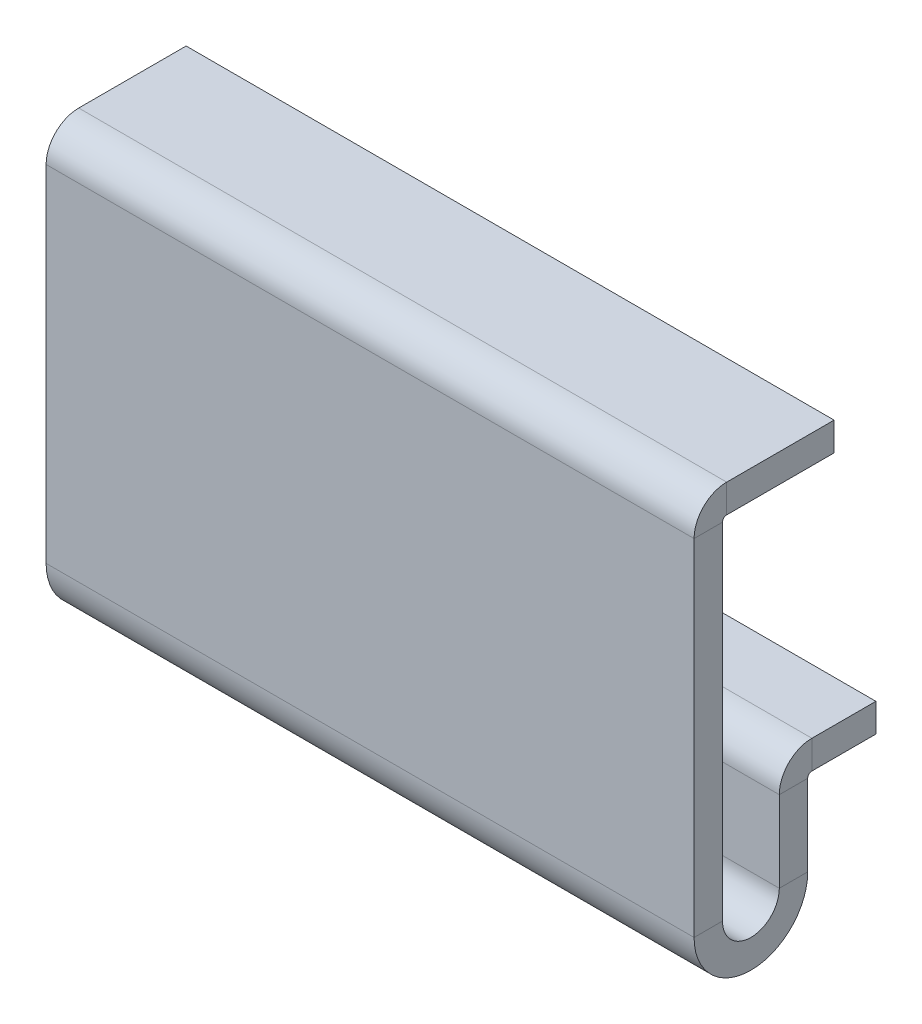
ISO-10303-21;
HEADER;
FILE_DESCRIPTION(('STEP AP214'),'2;1');
FILE_NAME('part.step','',(''),(''),'','','');
FILE_SCHEMA(('AUTOMOTIVE_DESIGN { 1 0 10303 214 1 1 1 1 }'));
ENDSEC;
DATA;
#1=APPLICATION_CONTEXT('core data for automotive mechanical design processes');
#2=APPLICATION_PROTOCOL_DEFINITION('international standard','automotive_design',2000,#1);
#3=PRODUCT_CONTEXT('',#1,'mechanical');
#4=PRODUCT('Part','Part','',(#3));
#5=PRODUCT_RELATED_PRODUCT_CATEGORY('part','',(#4));
#6=PRODUCT_DEFINITION_FORMATION('','',#4);
#7=PRODUCT_DEFINITION_CONTEXT('part definition',#1,'design');
#8=PRODUCT_DEFINITION('design','',#6,#7);
#9=PRODUCT_DEFINITION_SHAPE('','',#8);
#10=(LENGTH_UNIT() NAMED_UNIT(*) SI_UNIT(.MILLI.,.METRE.));
#11=(NAMED_UNIT(*) PLANE_ANGLE_UNIT() SI_UNIT($,.RADIAN.));
#12=(NAMED_UNIT(*) SI_UNIT($,.STERADIAN.) SOLID_ANGLE_UNIT());
#13=UNCERTAINTY_MEASURE_WITH_UNIT(LENGTH_MEASURE(1.E-05),#10,'distance_accuracy_value','');
#14=(GEOMETRIC_REPRESENTATION_CONTEXT(3) GLOBAL_UNCERTAINTY_ASSIGNED_CONTEXT((#13)) GLOBAL_UNIT_ASSIGNED_CONTEXT((#10,
#11,#12)) REPRESENTATION_CONTEXT('',''));
#15=CARTESIAN_POINT('',(0.,0.,0.));
#16=DIRECTION('',(0.,0.,1.));
#17=DIRECTION('',(1.,0.,0.));
#18=AXIS2_PLACEMENT_3D('',#15,#16,#17);
#19=CARTESIAN_POINT('',(-57.0262748258092,18.2568575522724,-27.7533473212653));
#20=DIRECTION('',(-1.,0.,0.));
#21=DIRECTION('',(0.,-1.,0.));
#22=AXIS2_PLACEMENT_3D('',#19,#20,#21);
#23=PLANE('',#22);
#24=DIRECTION('',(0.,-1.,0.));
#25=VECTOR('',#24,1.);
#26=CARTESIAN_POINT('',(-57.0262748258092,18.2568575522724,-22.7533473212653));
#27=LINE('',#26,#25);
#28=CARTESIAN_POINT('',(-57.0262748258092,-5.73660000000002,-22.7533473212654));
#29=VERTEX_POINT('',#28);
#30=CARTESIAN_POINT('',(-57.0262748258092,-66.5418734121946,-22.7533473212656));
#31=VERTEX_POINT('',#30);
#32=EDGE_CURVE('E101',#29,#31,#27,.T.);
#33=ORIENTED_EDGE('',*,*,#32,.F.);
#34=DIRECTION('',(0.,0.,-1.));
#35=VECTOR('',#34,1.);
#36=CARTESIAN_POINT('',(-57.0262748258092,-5.73660000000001,-27.7533473212654));
#37=LINE('',#36,#35);
#38=CARTESIAN_POINT('',(-57.0262748258091,-5.7366,-27.7533473212654));
#39=VERTEX_POINT('',#38);
#40=EDGE_CURVE('E190',#29,#39,#37,.T.);
#41=ORIENTED_EDGE('',*,*,#40,.T.);
#42=DIRECTION('',(0.,-1.,0.));
#43=VECTOR('',#42,1.);
#44=CARTESIAN_POINT('',(-57.0262748258092,18.2568575522724,-27.7533473212653));
#45=LINE('',#44,#43);
#46=CARTESIAN_POINT('',(-57.0262748258092,-66.5418734121945,-27.7533473212656));
#47=VERTEX_POINT('',#46);
#48=EDGE_CURVE('E81',#39,#47,#45,.T.);
#49=ORIENTED_EDGE('',*,*,#48,.T.);
#50=DIRECTION('',(0.,0.,1.));
#51=VECTOR('',#50,1.);
#52=CARTESIAN_POINT('',(-57.0262748258092,-66.5418734121945,-27.7533473212656));
#53=LINE('',#52,#51);
#54=EDGE_CURVE('E316',#47,#31,#53,.T.);
#55=ORIENTED_EDGE('',*,*,#54,.T.);
#56=EDGE_LOOP('',(#33,#41,#49,#55));
#57=FACE_BOUND('',#56,.T.);
#58=ADVANCED_FACE('F77',(#57),#23,.T.);
#59=CARTESIAN_POINT('',(57.0262748258092,18.2568575522724,-27.7533473212653));
#60=DIRECTION('',(1.,0.,0.));
#61=DIRECTION('',(0.,1.,0.));
#62=AXIS2_PLACEMENT_3D('',#59,#60,#61);
#63=PLANE('',#62);
#64=DIRECTION('',(0.,1.,0.));
#65=VECTOR('',#64,1.);
#66=CARTESIAN_POINT('',(57.0262748258092,18.2568575522724,-27.7533473212653));
#67=LINE('',#66,#65);
#68=CARTESIAN_POINT('',(57.0262748258092,-66.5418734121945,-27.7533473212656));
#69=VERTEX_POINT('',#68);
#70=CARTESIAN_POINT('',(57.0262748258092,-5.7366,-27.7533473212654));
#71=VERTEX_POINT('',#70);
#72=EDGE_CURVE('E206',#69,#71,#67,.T.);
#73=ORIENTED_EDGE('',*,*,#72,.T.);
#74=DIRECTION('',(0.,0.,1.));
#75=VECTOR('',#74,1.);
#76=CARTESIAN_POINT('',(57.0262748258092,-5.73660000000001,-27.7533473212654));
#77=LINE('',#76,#75);
#78=CARTESIAN_POINT('',(57.0262748258092,-5.73660000000002,-22.7533473212654));
#79=VERTEX_POINT('',#78);
#80=EDGE_CURVE('E15',#71,#79,#77,.T.);
#81=ORIENTED_EDGE('',*,*,#80,.T.);
#82=DIRECTION('',(0.,1.,0.));
#83=VECTOR('',#82,1.);
#84=CARTESIAN_POINT('',(57.0262748258092,18.2568575522724,-22.7533473212653));
#85=LINE('',#84,#83);
#86=CARTESIAN_POINT('',(57.0262748258092,-66.5418734121946,-22.7533473212656));
#87=VERTEX_POINT('',#86);
#88=EDGE_CURVE('E94',#87,#79,#85,.T.);
#89=ORIENTED_EDGE('',*,*,#88,.F.);
#90=DIRECTION('',(0.,0.,1.));
#91=VECTOR('',#90,1.);
#92=CARTESIAN_POINT('',(57.0262748258092,-66.5418734121945,-27.7533473212656));
#93=LINE('',#92,#91);
#94=EDGE_CURVE('E324',#69,#87,#93,.T.);
#95=ORIENTED_EDGE('',*,*,#94,.F.);
#96=EDGE_LOOP('',(#73,#81,#89,#95));
#97=FACE_BOUND('',#96,.T.);
#98=ADVANCED_FACE('F79',(#97),#63,.T.);
#99=CARTESIAN_POINT('',(0.,-29.1425079299611,-22.7533473212655));
#100=DIRECTION('',(0.,0.,1.));
#101=DIRECTION('',(0.,-1.,0.));
#102=AXIS2_PLACEMENT_3D('',#99,#100,#101);
#103=PLANE('',#102);
#104=ORIENTED_EDGE('',*,*,#88,.T.);
#105=DIRECTION('',(-1.,0.,0.));
#106=VECTOR('',#105,1.);
#107=CARTESIAN_POINT('',(0.,-5.73660000000003,-22.7533473212654));
#108=LINE('',#107,#106);
#109=EDGE_CURVE('E86',#79,#29,#108,.T.);
#110=ORIENTED_EDGE('',*,*,#109,.T.);
#111=ORIENTED_EDGE('',*,*,#32,.T.);
#112=DIRECTION('',(-1.,0.,0.));
#113=VECTOR('',#112,1.);
#114=CARTESIAN_POINT('',(-57.0262748258092,-66.5418734121946,-22.7533473212656));
#115=LINE('',#114,#113);
#116=EDGE_CURVE('E310',#31,#87,#115,.F.);
#117=ORIENTED_EDGE('',*,*,#116,.T.);
#118=EDGE_LOOP('',(#104,#110,#111,#117));
#119=FACE_BOUND('',#118,.T.);
#120=ADVANCED_FACE('F351',(#119),#103,.T.);
#121=CARTESIAN_POINT('',(57.0262748258092,-56.5418734121945,-42.7533473212656));
#122=DIRECTION('',(-1.,0.,0.));
#123=DIRECTION('',(0.,1.,0.));
#124=AXIS2_PLACEMENT_3D('',#121,#122,#123);
#125=PLANE('',#124);
#126=DIRECTION('',(0.,1.,0.));
#127=VECTOR('',#126,1.);
#128=CARTESIAN_POINT('',(57.0262748258092,-56.5418734121945,-42.7533473212656));
#129=LINE('',#128,#127);
#130=CARTESIAN_POINT('',(57.0262748258092,-66.5418734121945,-42.7533473212656));
#131=VERTEX_POINT('',#130);
#132=CARTESIAN_POINT('',(57.0262748258092,-52.2784734121945,-42.7533473212656));
#133=VERTEX_POINT('',#132);
#134=EDGE_CURVE('E334',#131,#133,#129,.T.);
#135=ORIENTED_EDGE('',*,*,#134,.T.);
#136=DIRECTION('',(0.,0.,1.));
#137=VECTOR('',#136,1.);
#138=CARTESIAN_POINT('',(57.0262748258092,-52.2784734121945,-42.7533473212656));
#139=LINE('',#138,#137);
#140=CARTESIAN_POINT('',(57.0262748258092,-52.2784734121945,-37.7533473212656));
#141=VERTEX_POINT('',#140);
#142=EDGE_CURVE('E294',#133,#141,#139,.T.);
#143=ORIENTED_EDGE('',*,*,#142,.T.);
#144=DIRECTION('',(0.,1.,0.));
#145=VECTOR('',#144,1.);
#146=CARTESIAN_POINT('',(57.0262748258092,-56.5418734121945,-37.7533473212656));
#147=LINE('',#146,#145);
#148=CARTESIAN_POINT('',(57.0262748258092,-66.5418734121945,-37.7533473212656));
#149=VERTEX_POINT('',#148);
#150=EDGE_CURVE('E326',#149,#141,#147,.T.);
#151=ORIENTED_EDGE('',*,*,#150,.F.);
#152=DIRECTION('',(0.,0.,-1.));
#153=VECTOR('',#152,1.);
#154=CARTESIAN_POINT('',(57.0262748258092,-66.5418734121945,-42.7533473212657));
#155=LINE('',#154,#153);
#156=EDGE_CURVE('E345',#149,#131,#155,.T.);
#157=ORIENTED_EDGE('',*,*,#156,.T.);
#158=EDGE_LOOP('',(#135,#143,#151,#157));
#159=FACE_BOUND('',#158,.T.);
#160=ADVANCED_FACE('F377',(#159),#125,.F.);
#161=CARTESIAN_POINT('',(0.,-56.5418734121945,-42.7533473212656));
#162=DIRECTION('',(0.,0.,-1.));
#163=DIRECTION('',(0.,1.,0.));
#164=AXIS2_PLACEMENT_3D('',#161,#162,#163);
#165=PLANE('',#164);
#166=DIRECTION('',(0.,-1.,0.));
#167=VECTOR('',#166,1.);
#168=CARTESIAN_POINT('',(-57.0262748258092,-56.5418734121945,-42.7533473212656));
#169=LINE('',#168,#167);
#170=CARTESIAN_POINT('',(-57.0262748258092,-52.2784734121945,-42.7533473212656));
#171=VERTEX_POINT('',#170);
#172=CARTESIAN_POINT('',(-57.0262748258092,-66.5418734121945,-42.7533473212657));
#173=VERTEX_POINT('',#172);
#174=EDGE_CURVE('E328',#171,#173,#169,.T.);
#175=ORIENTED_EDGE('',*,*,#174,.F.);
#176=DIRECTION('',(1.,0.,0.));
#177=VECTOR('',#176,1.);
#178=CARTESIAN_POINT('',(57.0262748258092,-52.2784734121945,-42.7533473212656));
#179=LINE('',#178,#177);
#180=EDGE_CURVE('E300',#133,#171,#179,.F.);
#181=ORIENTED_EDGE('',*,*,#180,.F.);
#182=ORIENTED_EDGE('',*,*,#134,.F.);
#183=DIRECTION('',(1.,0.,0.));
#184=VECTOR('',#183,1.);
#185=CARTESIAN_POINT('',(0.,-66.5418734121945,-42.7533473212657));
#186=LINE('',#185,#184);
#187=EDGE_CURVE('E331',#173,#131,#186,.T.);
#188=ORIENTED_EDGE('',*,*,#187,.F.);
#189=EDGE_LOOP('',(#175,#181,#182,#188));
#190=FACE_BOUND('',#189,.T.);
#191=ADVANCED_FACE('F429',(#190),#165,.T.);
#192=CARTESIAN_POINT('',(0.,-56.5418734121945,-37.7533473212656));
#193=DIRECTION('',(0.,0.,-1.));
#194=DIRECTION('',(0.,1.,0.));
#195=AXIS2_PLACEMENT_3D('',#192,#193,#194);
#196=PLANE('',#195);
#197=DIRECTION('',(1.,0.,0.));
#198=VECTOR('',#197,1.);
#199=CARTESIAN_POINT('',(57.0262748258092,-52.2784734121945,-37.7533473212656));
#200=LINE('',#199,#198);
#201=CARTESIAN_POINT('',(-57.0262748258092,-52.2784734121945,-37.7533473212656));
#202=VERTEX_POINT('',#201);
#203=EDGE_CURVE('E288',#141,#202,#200,.F.);
#204=ORIENTED_EDGE('',*,*,#203,.T.);
#205=DIRECTION('',(0.,1.,0.));
#206=VECTOR('',#205,1.);
#207=CARTESIAN_POINT('',(-57.0262748258092,-56.5418734121945,-37.7533473212656));
#208=LINE('',#207,#206);
#209=CARTESIAN_POINT('',(-57.0262748258092,-66.5418734121945,-37.7533473212656));
#210=VERTEX_POINT('',#209);
#211=EDGE_CURVE('E337',#202,#210,#208,.F.);
#212=ORIENTED_EDGE('',*,*,#211,.T.);
#213=DIRECTION('',(1.,0.,0.));
#214=VECTOR('',#213,1.);
#215=CARTESIAN_POINT('',(0.,-66.5418734121945,-37.7533473212656));
#216=LINE('',#215,#214);
#217=EDGE_CURVE('E339',#210,#149,#216,.T.);
#218=ORIENTED_EDGE('',*,*,#217,.T.);
#219=ORIENTED_EDGE('',*,*,#150,.T.);
#220=EDGE_LOOP('',(#204,#212,#218,#219));
#221=FACE_BOUND('',#220,.T.);
#222=ADVANCED_FACE('F373',(#221),#196,.F.);
#223=CARTESIAN_POINT('',(0.,-29.1425079299611,-27.7533473212655));
#224=DIRECTION('',(0.,0.,1.));
#225=DIRECTION('',(0.,-1.,0.));
#226=AXIS2_PLACEMENT_3D('',#223,#224,#225);
#227=PLANE('',#226);
#228=DIRECTION('',(-1.,0.,0.));
#229=VECTOR('',#228,1.);
#230=CARTESIAN_POINT('',(0.,-5.73660000000001,-27.7533473212654));
#231=LINE('',#230,#229);
#232=EDGE_CURVE('E197',#71,#39,#231,.T.);
#233=ORIENTED_EDGE('',*,*,#232,.F.);
#234=ORIENTED_EDGE('',*,*,#72,.F.);
#235=DIRECTION('',(-1.,0.,0.));
#236=VECTOR('',#235,1.);
#237=CARTESIAN_POINT('',(-57.0262748258092,-66.5418734121945,-27.7533473212656));
#238=LINE('',#237,#236);
#239=EDGE_CURVE('E205',#47,#69,#238,.F.);
#240=ORIENTED_EDGE('',*,*,#239,.F.);
#241=ORIENTED_EDGE('',*,*,#48,.F.);
#242=EDGE_LOOP('',(#233,#234,#240,#241));
#243=FACE_BOUND('',#242,.T.);
#244=ADVANCED_FACE('F202',(#243),#227,.F.);
#245=CARTESIAN_POINT('',(-57.0262748258092,-56.5418734121945,-42.7533473212656));
#246=DIRECTION('',(1.,0.,0.));
#247=DIRECTION('',(0.,-1.,0.));
#248=AXIS2_PLACEMENT_3D('',#245,#246,#247);
#249=PLANE('',#248);
#250=DIRECTION('',(0.,0.,1.));
#251=VECTOR('',#250,1.);
#252=CARTESIAN_POINT('',(-57.0262748258092,-52.2784734121945,-42.7533473212656));
#253=LINE('',#252,#251);
#254=EDGE_CURVE('E305',#171,#202,#253,.T.);
#255=ORIENTED_EDGE('',*,*,#254,.F.);
#256=ORIENTED_EDGE('',*,*,#174,.T.);
#257=DIRECTION('',(0.,0.,-1.));
#258=VECTOR('',#257,1.);
#259=CARTESIAN_POINT('',(-57.0262748258092,-66.5418734121945,-42.7533473212657));
#260=LINE('',#259,#258);
#261=EDGE_CURVE('E330',#210,#173,#260,.T.);
#262=ORIENTED_EDGE('',*,*,#261,.F.);
#263=ORIENTED_EDGE('',*,*,#211,.F.);
#264=EDGE_LOOP('',(#255,#256,#262,#263));
#265=FACE_BOUND('',#264,.T.);
#266=ADVANCED_FACE('F365',(#265),#249,.F.);
#267=CARTESIAN_POINT('',(57.0262748258092,-66.5418734121945,-32.7533473212656));
#268=DIRECTION('',(1.,0.,0.));
#269=DIRECTION('',(0.,1.,0.));
#270=AXIS2_PLACEMENT_3D('',#267,#268,#269);
#271=PLANE('',#270);
#272=ORIENTED_EDGE('',*,*,#156,.F.);
#273=CARTESIAN_POINT('',(57.0262748258092,-66.5418734121945,-32.7533473212656));
#274=DIRECTION('',(-1.,0.,0.));
#275=DIRECTION('',(0.,-1.,0.));
#276=AXIS2_PLACEMENT_3D('',#273,#274,#275);
#277=CIRCLE('',#276,5.);
#278=EDGE_CURVE('E319',#69,#149,#277,.F.);
#279=ORIENTED_EDGE('',*,*,#278,.F.);
#280=ORIENTED_EDGE('',*,*,#94,.T.);
#281=CARTESIAN_POINT('',(57.0262748258092,-66.5418734121945,-32.7533473212656));
#282=DIRECTION('',(-1.,0.,0.));
#283=DIRECTION('',(0.,-1.,0.));
#284=AXIS2_PLACEMENT_3D('',#281,#282,#283);
#285=CIRCLE('',#284,10.);
#286=EDGE_CURVE('E312',#87,#131,#285,.F.);
#287=ORIENTED_EDGE('',*,*,#286,.T.);
#288=EDGE_LOOP('',(#272,#279,#280,#287));
#289=FACE_BOUND('',#288,.T.);
#290=ADVANCED_FACE('F380',(#289),#271,.T.);
#291=CARTESIAN_POINT('',(-57.0262748258092,-66.5418734121945,-32.7533473212656));
#292=DIRECTION('',(1.,0.,0.));
#293=DIRECTION('',(0.,1.,0.));
#294=AXIS2_PLACEMENT_3D('',#291,#292,#293);
#295=PLANE('',#294);
#296=CARTESIAN_POINT('',(-57.0262748258092,-66.5418734121945,-32.7533473212656));
#297=DIRECTION('',(-1.,0.,0.));
#298=DIRECTION('',(0.,-1.,0.));
#299=AXIS2_PLACEMENT_3D('',#296,#297,#298);
#300=CIRCLE('',#299,5.);
#301=EDGE_CURVE('E308',#210,#47,#300,.T.);
#302=ORIENTED_EDGE('',*,*,#301,.F.);
#303=ORIENTED_EDGE('',*,*,#261,.T.);
#304=CARTESIAN_POINT('',(-57.0262748258092,-66.5418734121945,-32.7533473212656));
#305=DIRECTION('',(-1.,0.,0.));
#306=DIRECTION('',(0.,-1.,0.));
#307=AXIS2_PLACEMENT_3D('',#304,#305,#306);
#308=CIRCLE('',#307,10.);
#309=EDGE_CURVE('E313',#173,#31,#308,.T.);
#310=ORIENTED_EDGE('',*,*,#309,.T.);
#311=ORIENTED_EDGE('',*,*,#54,.F.);
#312=EDGE_LOOP('',(#302,#303,#310,#311));
#313=FACE_BOUND('',#312,.T.);
#314=ADVANCED_FACE('F360',(#313),#295,.F.);
#315=CARTESIAN_POINT('',(-57.0262748258092,-66.5418734121945,-32.7533473212656));
#316=DIRECTION('',(-1.,0.,0.));
#317=DIRECTION('',(0.,0.,-1.));
#318=AXIS2_PLACEMENT_3D('',#315,#316,#317);
#319=CYLINDRICAL_SURFACE('',#318,10.);
#320=ORIENTED_EDGE('',*,*,#116,.F.);
#321=ORIENTED_EDGE('',*,*,#309,.F.);
#322=ORIENTED_EDGE('',*,*,#187,.T.);
#323=ORIENTED_EDGE('',*,*,#286,.F.);
#324=EDGE_LOOP('',(#320,#321,#322,#323));
#325=FACE_BOUND('',#324,.T.);
#326=ADVANCED_FACE('F356',(#325),#319,.T.);
#327=CARTESIAN_POINT('',(-57.0262748258092,-66.5418734121945,-32.7533473212656));
#328=DIRECTION('',(-1.,0.,0.));
#329=DIRECTION('',(0.,0.,-1.));
#330=AXIS2_PLACEMENT_3D('',#327,#328,#329);
#331=CYLINDRICAL_SURFACE('',#330,5.);
#332=ORIENTED_EDGE('',*,*,#239,.T.);
#333=ORIENTED_EDGE('',*,*,#278,.T.);
#334=ORIENTED_EDGE('',*,*,#217,.F.);
#335=ORIENTED_EDGE('',*,*,#301,.T.);
#336=EDGE_LOOP('',(#332,#333,#334,#335));
#337=FACE_BOUND('',#336,.T.);
#338=ADVANCED_FACE('F369',(#337),#331,.F.);
#339=CARTESIAN_POINT('',(-57.0262748258092,-52.2784734121945,-43.4899473212656));
#340=DIRECTION('',(-1.,0.,0.));
#341=DIRECTION('',(0.,-1.,0.));
#342=AXIS2_PLACEMENT_3D('',#339,#340,#341);
#343=PLANE('',#342);
#344=DIRECTION('',(0.,-1.,0.));
#345=VECTOR('',#344,1.);
#346=CARTESIAN_POINT('',(-57.0262748258092,-46.5418734121945,-43.4899473212655));
#347=LINE('',#346,#345);
#348=CARTESIAN_POINT('',(-57.0262748258092,-51.5418734121945,-43.4899473212656));
#349=VERTEX_POINT('',#348);
#350=CARTESIAN_POINT('',(-57.0262748258092,-46.5418734121945,-43.4899473212656));
#351=VERTEX_POINT('',#350);
#352=EDGE_CURVE('E235',#349,#351,#347,.F.);
#353=ORIENTED_EDGE('',*,*,#352,.F.);
#354=CARTESIAN_POINT('',(-57.0262748258092,-52.2784734121945,-43.4899473212656));
#355=DIRECTION('',(1.,0.,0.));
#356=DIRECTION('',(0.,1.,0.));
#357=AXIS2_PLACEMENT_3D('',#354,#355,#356);
#358=CIRCLE('',#357,0.7366);
#359=EDGE_CURVE('E297',#171,#349,#358,.F.);
#360=ORIENTED_EDGE('',*,*,#359,.F.);
#361=ORIENTED_EDGE('',*,*,#254,.T.);
#362=CARTESIAN_POINT('',(-57.0262748258092,-52.2784734121945,-43.4899473212656));
#363=DIRECTION('',(1.,0.,0.));
#364=DIRECTION('',(0.,1.,0.));
#365=AXIS2_PLACEMENT_3D('',#362,#363,#364);
#366=CIRCLE('',#365,5.7366);
#367=EDGE_CURVE('E290',#202,#351,#366,.F.);
#368=ORIENTED_EDGE('',*,*,#367,.T.);
#369=EDGE_LOOP('',(#353,#360,#361,#368));
#370=FACE_BOUND('',#369,.T.);
#371=ADVANCED_FACE('F446',(#370),#343,.T.);
#372=CARTESIAN_POINT('',(57.0262748258092,-52.2784734121945,-43.4899473212656));
#373=DIRECTION('',(-1.,0.,0.));
#374=DIRECTION('',(0.,-1.,0.));
#375=AXIS2_PLACEMENT_3D('',#372,#373,#374);
#376=PLANE('',#375);
#377=CARTESIAN_POINT('',(57.0262748258092,-52.2784734121945,-43.4899473212656));
#378=DIRECTION('',(1.,0.,0.));
#379=DIRECTION('',(0.,1.,0.));
#380=AXIS2_PLACEMENT_3D('',#377,#378,#379);
#381=CIRCLE('',#380,0.7366);
#382=CARTESIAN_POINT('',(57.0262748258092,-51.5418734121945,-43.4899473212656));
#383=VERTEX_POINT('',#382);
#384=EDGE_CURVE('E261',#383,#133,#381,.T.);
#385=ORIENTED_EDGE('',*,*,#384,.F.);
#386=DIRECTION('',(0.,-1.,0.));
#387=VECTOR('',#386,1.);
#388=CARTESIAN_POINT('',(57.0262748258092,-51.5418734121945,-43.4899473212656));
#389=LINE('',#388,#387);
#390=CARTESIAN_POINT('',(57.0262748258092,-46.5418734121945,-43.4899473212655));
#391=VERTEX_POINT('',#390);
#392=EDGE_CURVE('E281',#383,#391,#389,.F.);
#393=ORIENTED_EDGE('',*,*,#392,.T.);
#394=CARTESIAN_POINT('',(57.0262748258092,-52.2784734121945,-43.4899473212656));
#395=DIRECTION('',(1.,0.,0.));
#396=DIRECTION('',(0.,1.,0.));
#397=AXIS2_PLACEMENT_3D('',#394,#395,#396);
#398=CIRCLE('',#397,5.7366);
#399=EDGE_CURVE('E291',#391,#141,#398,.T.);
#400=ORIENTED_EDGE('',*,*,#399,.T.);
#401=ORIENTED_EDGE('',*,*,#142,.F.);
#402=EDGE_LOOP('',(#385,#393,#400,#401));
#403=FACE_BOUND('',#402,.T.);
#404=ADVANCED_FACE('F449',(#403),#376,.F.);
#405=CARTESIAN_POINT('',(57.0262748258092,-52.2784734121945,-43.4899473212656));
#406=DIRECTION('',(1.,0.,0.));
#407=DIRECTION('',(0.,1.,0.));
#408=AXIS2_PLACEMENT_3D('',#405,#406,#407);
#409=CYLINDRICAL_SURFACE('',#408,5.7366);
#410=ORIENTED_EDGE('',*,*,#203,.F.);
#411=ORIENTED_EDGE('',*,*,#399,.F.);
#412=DIRECTION('',(1.,0.,0.));
#413=VECTOR('',#412,1.);
#414=CARTESIAN_POINT('',(-57.0262748258092,-46.5418734121945,-43.4899473212655));
#415=LINE('',#414,#413);
#416=EDGE_CURVE('E279',#391,#351,#415,.F.);
#417=ORIENTED_EDGE('',*,*,#416,.T.);
#418=ORIENTED_EDGE('',*,*,#367,.F.);
#419=EDGE_LOOP('',(#410,#411,#417,#418));
#420=FACE_BOUND('',#419,.T.);
#421=ADVANCED_FACE('F452',(#420),#409,.T.);
#422=CARTESIAN_POINT('',(57.0262748258092,-52.2784734121945,-43.4899473212656));
#423=DIRECTION('',(1.,0.,0.));
#424=DIRECTION('',(0.,1.,0.));
#425=AXIS2_PLACEMENT_3D('',#422,#423,#424);
#426=CYLINDRICAL_SURFACE('',#425,0.7366);
#427=ORIENTED_EDGE('',*,*,#180,.T.);
#428=ORIENTED_EDGE('',*,*,#359,.T.);
#429=DIRECTION('',(1.,0.,0.));
#430=VECTOR('',#429,1.);
#431=CARTESIAN_POINT('',(-57.0262748258092,-51.5418734121945,-43.4899473212656));
#432=LINE('',#431,#430);
#433=EDGE_CURVE('E284',#349,#383,#432,.T.);
#434=ORIENTED_EDGE('',*,*,#433,.T.);
#435=ORIENTED_EDGE('',*,*,#384,.T.);
#436=EDGE_LOOP('',(#427,#428,#434,#435));
#437=FACE_BOUND('',#436,.T.);
#438=ADVANCED_FACE('F457',(#437),#426,.F.);
#439=CARTESIAN_POINT('',(57.0262748258092,-46.5418734121944,-54.7533473212656));
#440=DIRECTION('',(-1.,0.,0.));
#441=DIRECTION('',(0.,-1.,0.));
#442=AXIS2_PLACEMENT_3D('',#439,#440,#441);
#443=PLANE('',#442);
#444=ORIENTED_EDGE('',*,*,#392,.F.);
#445=DIRECTION('',(0.,0.,1.));
#446=VECTOR('',#445,1.);
#447=CARTESIAN_POINT('',(57.0262748258092,-51.5418734121944,-54.7533473212656));
#448=LINE('',#447,#446);
#449=CARTESIAN_POINT('',(57.0262748258092,-51.5418734121944,-54.7533473212656));
#450=VERTEX_POINT('',#449);
#451=EDGE_CURVE('E277',#383,#450,#448,.F.);
#452=ORIENTED_EDGE('',*,*,#451,.T.);
#453=DIRECTION('',(0.,-1.,0.));
#454=VECTOR('',#453,1.);
#455=CARTESIAN_POINT('',(57.0262748258092,-46.5418734121944,-54.7533473212656));
#456=LINE('',#455,#454);
#457=CARTESIAN_POINT('',(57.0262748258092,-46.5418734121944,-54.7533473212656));
#458=VERTEX_POINT('',#457);
#459=EDGE_CURVE('E258',#458,#450,#456,.T.);
#460=ORIENTED_EDGE('',*,*,#459,.F.);
#461=DIRECTION('',(0.,0.,-1.));
#462=VECTOR('',#461,1.);
#463=CARTESIAN_POINT('',(57.0262748258092,-46.5418734121946,-22.7533473212656));
#464=LINE('',#463,#462);
#465=EDGE_CURVE('E270',#391,#458,#464,.T.);
#466=ORIENTED_EDGE('',*,*,#465,.F.);
#467=EDGE_LOOP('',(#444,#452,#460,#466));
#468=FACE_BOUND('',#467,.T.);
#469=ADVANCED_FACE('F460',(#468),#443,.F.);
#470=CARTESIAN_POINT('',(-57.0262748258092,-46.5418734121945,-42.7533473212656));
#471=DIRECTION('',(1.,0.,0.));
#472=DIRECTION('',(0.,1.,0.));
#473=AXIS2_PLACEMENT_3D('',#470,#471,#472);
#474=PLANE('',#473);
#475=ORIENTED_EDGE('',*,*,#352,.T.);
#476=DIRECTION('',(0.,0.,1.));
#477=VECTOR('',#476,1.);
#478=CARTESIAN_POINT('',(-57.0262748258092,-46.5418734121946,-22.7533473212656));
#479=LINE('',#478,#477);
#480=CARTESIAN_POINT('',(-57.0262748258092,-46.5418734121944,-54.7533473212656));
#481=VERTEX_POINT('',#480);
#482=EDGE_CURVE('E265',#481,#351,#479,.T.);
#483=ORIENTED_EDGE('',*,*,#482,.F.);
#484=DIRECTION('',(0.,-1.,0.));
#485=VECTOR('',#484,1.);
#486=CARTESIAN_POINT('',(-57.0262748258092,-46.5418734121944,-54.7533473212656));
#487=LINE('',#486,#485);
#488=CARTESIAN_POINT('',(-57.0262748258092,-51.5418734121944,-54.7533473212656));
#489=VERTEX_POINT('',#488);
#490=EDGE_CURVE('E262',#481,#489,#487,.T.);
#491=ORIENTED_EDGE('',*,*,#490,.T.);
#492=DIRECTION('',(0.,0.,-1.));
#493=VECTOR('',#492,1.);
#494=CARTESIAN_POINT('',(-57.0262748258092,-51.5418734121945,-42.7533473212656));
#495=LINE('',#494,#493);
#496=EDGE_CURVE('E272',#489,#349,#495,.F.);
#497=ORIENTED_EDGE('',*,*,#496,.T.);
#498=EDGE_LOOP('',(#475,#483,#491,#497));
#499=FACE_BOUND('',#498,.T.);
#500=ADVANCED_FACE('F466',(#499),#474,.F.);
#501=CARTESIAN_POINT('',(0.,-46.5418734121946,-22.7533473212656));
#502=DIRECTION('',(0.,-1.,0.));
#503=DIRECTION('',(0.,0.,-1.));
#504=AXIS2_PLACEMENT_3D('',#501,#502,#503);
#505=PLANE('',#504);
#506=ORIENTED_EDGE('',*,*,#416,.F.);
#507=ORIENTED_EDGE('',*,*,#465,.T.);
#508=DIRECTION('',(-1.,0.,0.));
#509=VECTOR('',#508,1.);
#510=CARTESIAN_POINT('',(0.,-46.5418734121944,-54.7533473212656));
#511=LINE('',#510,#509);
#512=EDGE_CURVE('E268',#458,#481,#511,.T.);
#513=ORIENTED_EDGE('',*,*,#512,.T.);
#514=ORIENTED_EDGE('',*,*,#482,.T.);
#515=EDGE_LOOP('',(#506,#507,#513,#514));
#516=FACE_BOUND('',#515,.T.);
#517=ADVANCED_FACE('F471',(#516),#505,.F.);
#518=CARTESIAN_POINT('',(0.,-51.5418734121946,-22.7533473212657));
#519=DIRECTION('',(0.,-1.,0.));
#520=DIRECTION('',(0.,0.,-1.));
#521=AXIS2_PLACEMENT_3D('',#518,#519,#520);
#522=PLANE('',#521);
#523=ORIENTED_EDGE('',*,*,#451,.F.);
#524=ORIENTED_EDGE('',*,*,#433,.F.);
#525=ORIENTED_EDGE('',*,*,#496,.F.);
#526=DIRECTION('',(1.,0.,0.));
#527=VECTOR('',#526,1.);
#528=CARTESIAN_POINT('',(-57.0262748258092,-51.5418734121944,-54.7533473212656));
#529=LINE('',#528,#527);
#530=EDGE_CURVE('E275',#450,#489,#529,.F.);
#531=ORIENTED_EDGE('',*,*,#530,.F.);
#532=EDGE_LOOP('',(#523,#524,#525,#531));
#533=FACE_BOUND('',#532,.T.);
#534=ADVANCED_FACE('F414',(#533),#522,.T.);
#535=CARTESIAN_POINT('',(-57.0262748258092,-46.5418734121944,-54.7533473212656));
#536=DIRECTION('',(0.,0.,1.));
#537=DIRECTION('',(0.,-1.,0.));
#538=AXIS2_PLACEMENT_3D('',#535,#536,#537);
#539=PLANE('',#538);
#540=ORIENTED_EDGE('',*,*,#530,.T.);
#541=ORIENTED_EDGE('',*,*,#490,.F.);
#542=ORIENTED_EDGE('',*,*,#512,.F.);
#543=ORIENTED_EDGE('',*,*,#459,.T.);
#544=EDGE_LOOP('',(#540,#541,#542,#543));
#545=FACE_BOUND('',#544,.T.);
#546=ADVANCED_FACE('F407',(#545),#539,.F.);
#547=CARTESIAN_POINT('',(-57.0262748258092,-5.,-47.3993654822335));
#548=DIRECTION('',(0.,0.,-1.));
#549=DIRECTION('',(-1.,0.,0.));
#550=AXIS2_PLACEMENT_3D('',#547,#548,#549);
#551=PLANE('',#550);
#552=DIRECTION('',(-1.,0.,0.));
#553=VECTOR('',#552,1.);
#554=CARTESIAN_POINT('',(-57.0262748258092,0.,-47.3993654822335));
#555=LINE('',#554,#553);
#556=CARTESIAN_POINT('',(57.0262748258092,0.,-47.3993654822335));
#557=VERTEX_POINT('',#556);
#558=CARTESIAN_POINT('',(-57.0262748258092,0.,-47.3993654822335));
#559=VERTEX_POINT('',#558);
#560=EDGE_CURVE('E240',#557,#559,#555,.T.);
#561=ORIENTED_EDGE('',*,*,#560,.F.);
#562=DIRECTION('',(0.,1.,0.));
#563=VECTOR('',#562,1.);
#564=CARTESIAN_POINT('',(57.0262748258092,-5.,-47.3993654822335));
#565=LINE('',#564,#563);
#566=CARTESIAN_POINT('',(57.0262748258092,-5.,-47.3993654822335));
#567=VERTEX_POINT('',#566);
#568=EDGE_CURVE('E232',#567,#557,#565,.T.);
#569=ORIENTED_EDGE('',*,*,#568,.F.);
#570=DIRECTION('',(-1.,0.,0.));
#571=VECTOR('',#570,1.);
#572=CARTESIAN_POINT('',(-57.0262748258092,-5.,-47.3993654822335));
#573=LINE('',#572,#571);
#574=CARTESIAN_POINT('',(-57.0262748258092,-5.,-47.3993654822335));
#575=VERTEX_POINT('',#574);
#576=EDGE_CURVE('E252',#567,#575,#573,.T.);
#577=ORIENTED_EDGE('',*,*,#576,.T.);
#578=DIRECTION('',(0.,1.,0.));
#579=VECTOR('',#578,1.);
#580=CARTESIAN_POINT('',(-57.0262748258092,-5.,-47.3993654822335));
#581=LINE('',#580,#579);
#582=EDGE_CURVE('E250',#575,#559,#581,.T.);
#583=ORIENTED_EDGE('',*,*,#582,.T.);
#584=EDGE_LOOP('',(#561,#569,#577,#583));
#585=FACE_BOUND('',#584,.T.);
#586=ADVANCED_FACE('F405',(#585),#551,.T.);
#587=CARTESIAN_POINT('',(0.,-5.,0.));
#588=DIRECTION('',(0.,1.,0.));
#589=DIRECTION('',(0.,0.,1.));
#590=AXIS2_PLACEMENT_3D('',#587,#588,#589);
#591=PLANE('',#590);
#592=DIRECTION('',(0.,0.,-1.));
#593=VECTOR('',#592,1.);
#594=CARTESIAN_POINT('',(57.0262748258092,-5.,-47.3993654822335));
#595=LINE('',#594,#593);
#596=CARTESIAN_POINT('',(57.0262748258092,-5.,-28.4899473212654));
#597=VERTEX_POINT('',#596);
#598=EDGE_CURVE('E236',#597,#567,#595,.T.);
#599=ORIENTED_EDGE('',*,*,#598,.F.);
#600=DIRECTION('',(-1.,0.,0.));
#601=VECTOR('',#600,1.);
#602=CARTESIAN_POINT('',(0.,-5.,-28.4899473212654));
#603=LINE('',#602,#601);
#604=CARTESIAN_POINT('',(-57.0262748258091,-5.,-28.4899473212654));
#605=VERTEX_POINT('',#604);
#606=EDGE_CURVE('E247',#597,#605,#603,.T.);
#607=ORIENTED_EDGE('',*,*,#606,.T.);
#608=DIRECTION('',(0.,0.,1.));
#609=VECTOR('',#608,1.);
#610=CARTESIAN_POINT('',(-57.0262748258092,-5.,-47.3993654822335));
#611=LINE('',#610,#609);
#612=EDGE_CURVE('E245',#575,#605,#611,.T.);
#613=ORIENTED_EDGE('',*,*,#612,.F.);
#614=ORIENTED_EDGE('',*,*,#576,.F.);
#615=EDGE_LOOP('',(#599,#607,#613,#614));
#616=FACE_BOUND('',#615,.T.);
#617=ADVANCED_FACE('F403',(#616),#591,.F.);
#618=CARTESIAN_POINT('',(-57.0262748258092,-5.,-47.3993654822335));
#619=DIRECTION('',(-1.,0.,0.));
#620=DIRECTION('',(0.,0.,1.));
#621=AXIS2_PLACEMENT_3D('',#618,#619,#620);
#622=PLANE('',#621);
#623=DIRECTION('',(0.,-1.,0.));
#624=VECTOR('',#623,1.);
#625=CARTESIAN_POINT('',(-57.0262748258092,-5.,-28.4899473212654));
#626=LINE('',#625,#624);
#627=CARTESIAN_POINT('',(-57.0262748258092,0.,-28.4899473212654));
#628=VERTEX_POINT('',#627);
#629=EDGE_CURVE('E219',#628,#605,#626,.T.);
#630=ORIENTED_EDGE('',*,*,#629,.F.);
#631=DIRECTION('',(0.,0.,1.));
#632=VECTOR('',#631,1.);
#633=CARTESIAN_POINT('',(-57.0262748258092,0.,-47.3993654822335));
#634=LINE('',#633,#632);
#635=EDGE_CURVE('E238',#559,#628,#634,.T.);
#636=ORIENTED_EDGE('',*,*,#635,.F.);
#637=ORIENTED_EDGE('',*,*,#582,.F.);
#638=ORIENTED_EDGE('',*,*,#612,.T.);
#639=EDGE_LOOP('',(#630,#636,#637,#638));
#640=FACE_BOUND('',#639,.T.);
#641=ADVANCED_FACE('F399',(#640),#622,.T.);
#642=CARTESIAN_POINT('',(0.,0.,0.));
#643=DIRECTION('',(0.,1.,0.));
#644=DIRECTION('',(0.,0.,1.));
#645=AXIS2_PLACEMENT_3D('',#642,#643,#644);
#646=PLANE('',#645);
#647=DIRECTION('',(-1.,0.,0.));
#648=VECTOR('',#647,1.);
#649=CARTESIAN_POINT('',(0.,0.,-28.4899473212654));
#650=LINE('',#649,#648);
#651=CARTESIAN_POINT('',(57.0262748258092,0.,-28.4899473212654));
#652=VERTEX_POINT('',#651);
#653=EDGE_CURVE('E223',#652,#628,#650,.T.);
#654=ORIENTED_EDGE('',*,*,#653,.F.);
#655=DIRECTION('',(0.,0.,-1.));
#656=VECTOR('',#655,1.);
#657=CARTESIAN_POINT('',(57.0262748258092,0.,-47.3993654822335));
#658=LINE('',#657,#656);
#659=EDGE_CURVE('E243',#652,#557,#658,.T.);
#660=ORIENTED_EDGE('',*,*,#659,.T.);
#661=ORIENTED_EDGE('',*,*,#560,.T.);
#662=ORIENTED_EDGE('',*,*,#635,.T.);
#663=EDGE_LOOP('',(#654,#660,#661,#662));
#664=FACE_BOUND('',#663,.T.);
#665=ADVANCED_FACE('F396',(#664),#646,.T.);
#666=CARTESIAN_POINT('',(57.0262748258092,-5.,-47.3993654822335));
#667=DIRECTION('',(1.,0.,0.));
#668=DIRECTION('',(0.,0.,-1.));
#669=AXIS2_PLACEMENT_3D('',#666,#667,#668);
#670=PLANE('',#669);
#671=DIRECTION('',(0.,1.,0.));
#672=VECTOR('',#671,1.);
#673=CARTESIAN_POINT('',(57.0262748258092,-5.,-28.4899473212654));
#674=LINE('',#673,#672);
#675=EDGE_CURVE('E220',#597,#652,#674,.T.);
#676=ORIENTED_EDGE('',*,*,#675,.F.);
#677=ORIENTED_EDGE('',*,*,#598,.T.);
#678=ORIENTED_EDGE('',*,*,#568,.T.);
#679=ORIENTED_EDGE('',*,*,#659,.F.);
#680=EDGE_LOOP('',(#676,#677,#678,#679));
#681=FACE_BOUND('',#680,.T.);
#682=ADVANCED_FACE('F391',(#681),#670,.T.);
#683=CARTESIAN_POINT('',(57.0262748258092,-5.7366,-28.4899473212654));
#684=DIRECTION('',(-1.,0.,0.));
#685=DIRECTION('',(0.,0.,1.));
#686=AXIS2_PLACEMENT_3D('',#683,#684,#685);
#687=PLANE('',#686);
#688=ORIENTED_EDGE('',*,*,#675,.T.);
#689=CARTESIAN_POINT('',(57.0262748258092,-5.7366,-28.4899473212654));
#690=DIRECTION('',(-1.,0.,0.));
#691=DIRECTION('',(0.,0.,1.));
#692=AXIS2_PLACEMENT_3D('',#689,#690,#691);
#693=CIRCLE('',#692,5.7366);
#694=EDGE_CURVE('E229',#652,#79,#693,.F.);
#695=ORIENTED_EDGE('',*,*,#694,.T.);
#696=ORIENTED_EDGE('',*,*,#80,.F.);
#697=CARTESIAN_POINT('',(57.0262748258092,-5.7366,-28.4899473212654));
#698=DIRECTION('',(1.,0.,0.));
#699=DIRECTION('',(0.,0.,1.));
#700=AXIS2_PLACEMENT_3D('',#697,#698,#699);
#701=CIRCLE('',#700,0.7366);
#702=EDGE_CURVE('E214',#597,#71,#701,.T.);
#703=ORIENTED_EDGE('',*,*,#702,.F.);
#704=EDGE_LOOP('',(#688,#695,#696,#703));
#705=FACE_BOUND('',#704,.T.);
#706=ADVANCED_FACE('F388',(#705),#687,.F.);
#707=CARTESIAN_POINT('',(-57.0262748258091,-5.7366,-28.4899473212654));
#708=DIRECTION('',(1.,0.,0.));
#709=DIRECTION('',(0.,0.,-1.));
#710=AXIS2_PLACEMENT_3D('',#707,#708,#709);
#711=PLANE('',#710);
#712=ORIENTED_EDGE('',*,*,#40,.F.);
#713=CARTESIAN_POINT('',(-57.0262748258091,-5.7366,-28.4899473212654));
#714=DIRECTION('',(-1.,0.,0.));
#715=DIRECTION('',(0.,0.,1.));
#716=AXIS2_PLACEMENT_3D('',#713,#714,#715);
#717=CIRCLE('',#716,5.7366);
#718=EDGE_CURVE('E225',#29,#628,#717,.T.);
#719=ORIENTED_EDGE('',*,*,#718,.T.);
#720=ORIENTED_EDGE('',*,*,#629,.T.);
#721=CARTESIAN_POINT('',(-57.0262748258091,-5.7366,-28.4899473212654));
#722=DIRECTION('',(-1.,0.,0.));
#723=DIRECTION('',(0.,0.,-1.));
#724=AXIS2_PLACEMENT_3D('',#721,#722,#723);
#725=CIRCLE('',#724,0.7366);
#726=EDGE_CURVE('E212',#39,#605,#725,.T.);
#727=ORIENTED_EDGE('',*,*,#726,.F.);
#728=EDGE_LOOP('',(#712,#719,#720,#727));
#729=FACE_BOUND('',#728,.T.);
#730=ADVANCED_FACE('F217',(#729),#711,.F.);
#731=CARTESIAN_POINT('',(114.27524464453,-5.7366,-28.4899473212654));
#732=DIRECTION('',(-1.,0.,0.));
#733=DIRECTION('',(0.,0.,1.));
#734=AXIS2_PLACEMENT_3D('',#731,#732,#733);
#735=CYLINDRICAL_SURFACE('',#734,0.7366);
#736=ORIENTED_EDGE('',*,*,#726,.T.);
#737=ORIENTED_EDGE('',*,*,#606,.F.);
#738=ORIENTED_EDGE('',*,*,#702,.T.);
#739=ORIENTED_EDGE('',*,*,#232,.T.);
#740=EDGE_LOOP('',(#736,#737,#738,#739));
#741=FACE_BOUND('',#740,.T.);
#742=ADVANCED_FACE('F210',(#741),#735,.F.);
#743=CARTESIAN_POINT('',(114.27524464453,-5.7366,-28.4899473212654));
#744=DIRECTION('',(-1.,0.,0.));
#745=DIRECTION('',(0.,0.,1.));
#746=AXIS2_PLACEMENT_3D('',#743,#744,#745);
#747=CYLINDRICAL_SURFACE('',#746,5.7366);
#748=ORIENTED_EDGE('',*,*,#718,.F.);
#749=ORIENTED_EDGE('',*,*,#109,.F.);
#750=ORIENTED_EDGE('',*,*,#694,.F.);
#751=ORIENTED_EDGE('',*,*,#653,.T.);
#752=EDGE_LOOP('',(#748,#749,#750,#751));
#753=FACE_BOUND('',#752,.T.);
#754=ADVANCED_FACE('F387',(#753),#747,.T.);
#755=CLOSED_SHELL('',(#58,#98,#120,#160,#191,#222,#244,#266,#290,#314,#326,#338,#371,#404,#421,
#438,#469,#500,#517,#534,#546,#586,#617,#641,#665,#682,#706,#730,#742,#754));
#756=MANIFOLD_SOLID_BREP('B2',#755);
#757=ADVANCED_BREP_SHAPE_REPRESENTATION('',(#18,#756),#14);
#758=SHAPE_DEFINITION_REPRESENTATION(#9,#757);
ENDSEC;
END-ISO-10303-21;
